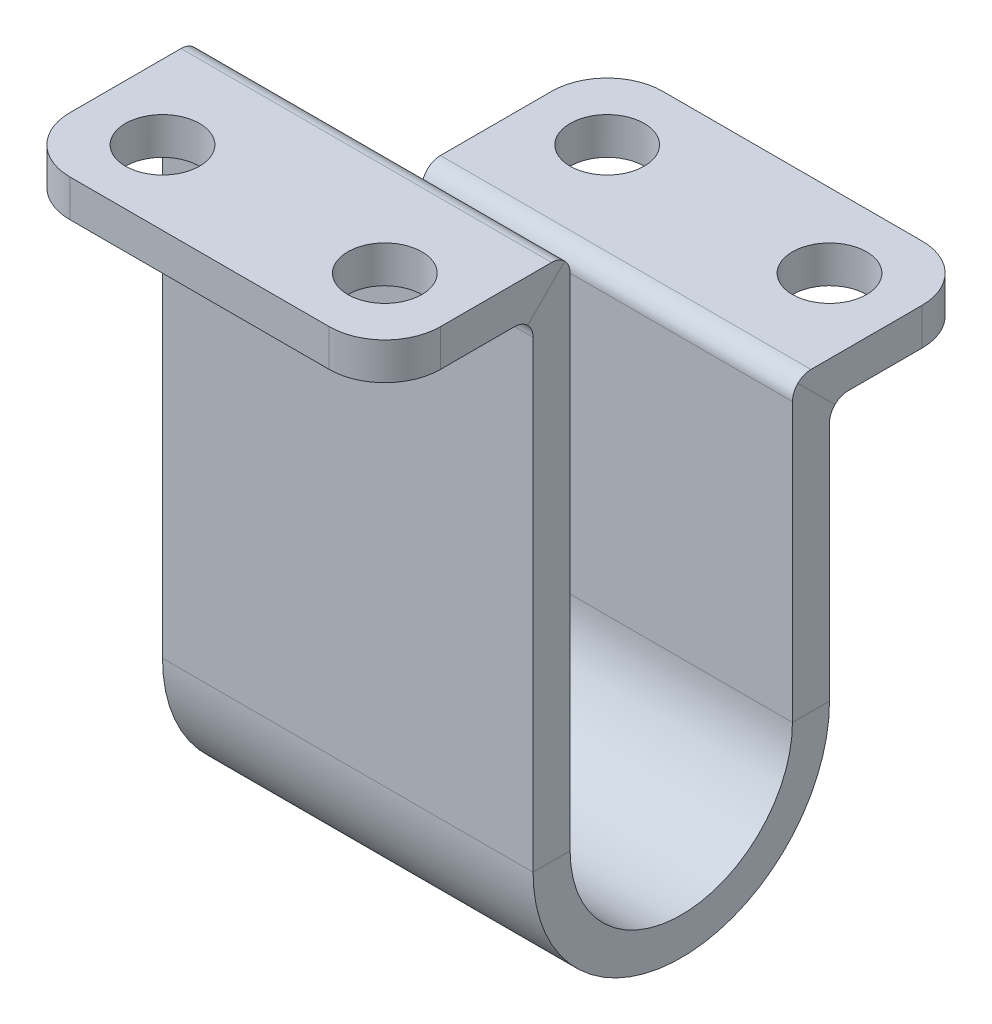
ISO-10303-21;
HEADER;
FILE_DESCRIPTION(('STEP AP214'),'2;1');
FILE_NAME('part.step','',(''),(''),'','','');
FILE_SCHEMA(('AUTOMOTIVE_DESIGN { 1 0 10303 214 1 1 1 1 }'));
ENDSEC;
DATA;
#1=APPLICATION_CONTEXT('core data for automotive mechanical design processes');
#2=APPLICATION_PROTOCOL_DEFINITION('international standard','automotive_design',2000,#1);
#3=PRODUCT_CONTEXT('',#1,'mechanical');
#4=PRODUCT('Part','Part','',(#3));
#5=PRODUCT_RELATED_PRODUCT_CATEGORY('part','',(#4));
#6=PRODUCT_DEFINITION_FORMATION('','',#4);
#7=PRODUCT_DEFINITION_CONTEXT('part definition',#1,'design');
#8=PRODUCT_DEFINITION('design','',#6,#7);
#9=PRODUCT_DEFINITION_SHAPE('','',#8);
#10=(LENGTH_UNIT() NAMED_UNIT(*) SI_UNIT(.MILLI.,.METRE.));
#11=(NAMED_UNIT(*) PLANE_ANGLE_UNIT() SI_UNIT($,.RADIAN.));
#12=(NAMED_UNIT(*) SI_UNIT($,.STERADIAN.) SOLID_ANGLE_UNIT());
#13=UNCERTAINTY_MEASURE_WITH_UNIT(LENGTH_MEASURE(1.E-05),#10,'distance_accuracy_value','');
#14=(GEOMETRIC_REPRESENTATION_CONTEXT(3) GLOBAL_UNCERTAINTY_ASSIGNED_CONTEXT((#13)) GLOBAL_UNIT_ASSIGNED_CONTEXT((#10,
#11,#12)) REPRESENTATION_CONTEXT('',''));
#15=CARTESIAN_POINT('',(0.,0.,0.));
#16=DIRECTION('',(0.,0.,1.));
#17=DIRECTION('',(1.,0.,0.));
#18=AXIS2_PLACEMENT_3D('',#15,#16,#17);
#19=CARTESIAN_POINT('',(0.,-30.,-80.));
#20=DIRECTION('',(0.,0.,1.));
#21=DIRECTION('',(1.,0.,0.));
#22=AXIS2_PLACEMENT_3D('',#19,#20,#21);
#23=PLANE('',#22);
#24=DIRECTION('',(-1.,0.,0.));
#25=VECTOR('',#24,1.);
#26=CARTESIAN_POINT('',(-25.,-27.5,-80.));
#27=LINE('',#26,#25);
#28=CARTESIAN_POINT('',(17.5,-27.5,-80.));
#29=VERTEX_POINT('',#28);
#30=CARTESIAN_POINT('',(-17.5,-27.5,-80.));
#31=VERTEX_POINT('',#30);
#32=EDGE_CURVE('E281',#29,#31,#27,.T.);
#33=ORIENTED_EDGE('',*,*,#32,.F.);
#34=DIRECTION('',(0.,1.,0.));
#35=VECTOR('',#34,1.);
#36=CARTESIAN_POINT('',(17.5,-30.,-80.));
#37=LINE('',#36,#35);
#38=CARTESIAN_POINT('',(17.5,-32.5,-80.));
#39=VERTEX_POINT('',#38);
#40=EDGE_CURVE('E56',#29,#39,#37,.F.);
#41=ORIENTED_EDGE('',*,*,#40,.T.);
#42=DIRECTION('',(1.,0.,0.));
#43=VECTOR('',#42,1.);
#44=CARTESIAN_POINT('',(-25.,-32.5,-80.));
#45=LINE('',#44,#43);
#46=CARTESIAN_POINT('',(-17.5,-32.5,-80.));
#47=VERTEX_POINT('',#46);
#48=EDGE_CURVE('E284',#47,#39,#45,.T.);
#49=ORIENTED_EDGE('',*,*,#48,.F.);
#50=DIRECTION('',(0.,-1.,0.));
#51=VECTOR('',#50,1.);
#52=CARTESIAN_POINT('',(-17.5,-30.,-80.));
#53=LINE('',#52,#51);
#54=EDGE_CURVE('E396',#47,#31,#53,.F.);
#55=ORIENTED_EDGE('',*,*,#54,.T.);
#56=EDGE_LOOP('',(#33,#41,#49,#55));
#57=FACE_BOUND('',#56,.T.);
#58=ADVANCED_FACE('F34',(#57),#23,.F.);
#59=CARTESIAN_POINT('',(0.,0.,0.));
#60=DIRECTION('',(0.,0.,1.));
#61=DIRECTION('',(1.,0.,0.));
#62=AXIS2_PLACEMENT_3D('',#59,#60,#61);
#63=PLANE('',#62);
#64=DIRECTION('',(1.,0.,0.));
#65=VECTOR('',#64,1.);
#66=CARTESIAN_POINT('',(-25.,-2.5,0.));
#67=LINE('',#66,#65);
#68=CARTESIAN_POINT('',(-17.5,-2.5,0.));
#69=VERTEX_POINT('',#68);
#70=CARTESIAN_POINT('',(17.5,-2.5,0.));
#71=VERTEX_POINT('',#70);
#72=EDGE_CURVE('E280',#69,#71,#67,.T.);
#73=ORIENTED_EDGE('',*,*,#72,.T.);
#74=DIRECTION('',(0.,1.,0.));
#75=VECTOR('',#74,1.);
#76=CARTESIAN_POINT('',(17.5,2.5,0.));
#77=LINE('',#76,#75);
#78=CARTESIAN_POINT('',(17.5,2.5,0.));
#79=VERTEX_POINT('',#78);
#80=EDGE_CURVE('E374',#71,#79,#77,.T.);
#81=ORIENTED_EDGE('',*,*,#80,.T.);
#82=DIRECTION('',(-1.,0.,0.));
#83=VECTOR('',#82,1.);
#84=CARTESIAN_POINT('',(-25.,2.5,0.));
#85=LINE('',#84,#83);
#86=CARTESIAN_POINT('',(-17.5,2.5,0.));
#87=VERTEX_POINT('',#86);
#88=EDGE_CURVE('E452',#79,#87,#85,.T.);
#89=ORIENTED_EDGE('',*,*,#88,.T.);
#90=DIRECTION('',(0.,-1.,0.));
#91=VECTOR('',#90,1.);
#92=CARTESIAN_POINT('',(-17.5,-2.5,0.));
#93=LINE('',#92,#91);
#94=EDGE_CURVE('E357',#87,#69,#93,.T.);
#95=ORIENTED_EDGE('',*,*,#94,.T.);
#96=EDGE_LOOP('',(#73,#81,#89,#95));
#97=FACE_BOUND('',#96,.T.);
#98=ADVANCED_FACE('F490',(#97),#63,.T.);
#99=CARTESIAN_POINT('',(-25.,-27.5,-54.65));
#100=DIRECTION('',(1.,0.,0.));
#101=DIRECTION('',(0.,0.,-1.));
#102=AXIS2_PLACEMENT_3D('',#99,#100,#101);
#103=PLANE('',#102);
#104=DIRECTION('',(0.,0.,-1.));
#105=VECTOR('',#104,1.);
#106=CARTESIAN_POINT('',(-25.,-27.5,-54.65));
#107=LINE('',#106,#105);
#108=CARTESIAN_POINT('',(-25.,-27.5,-57.5));
#109=VERTEX_POINT('',#108);
#110=CARTESIAN_POINT('',(-25.,-27.5,-72.5));
#111=VERTEX_POINT('',#110);
#112=EDGE_CURVE('E268',#109,#111,#107,.T.);
#113=ORIENTED_EDGE('',*,*,#112,.T.);
#114=DIRECTION('',(0.,-1.,0.));
#115=VECTOR('',#114,1.);
#116=CARTESIAN_POINT('',(-25.,-27.5,-72.5));
#117=LINE('',#116,#115);
#118=CARTESIAN_POINT('',(-25.,-32.5,-72.5));
#119=VERTEX_POINT('',#118);
#120=EDGE_CURVE('E11',#111,#119,#117,.T.);
#121=ORIENTED_EDGE('',*,*,#120,.T.);
#122=DIRECTION('',(0.,0.,-1.));
#123=VECTOR('',#122,1.);
#124=CARTESIAN_POINT('',(-25.,-32.5,-54.65));
#125=LINE('',#124,#123);
#126=CARTESIAN_POINT('',(-25.,-32.5,-62.5));
#127=VERTEX_POINT('',#126);
#128=EDGE_CURVE('E293',#127,#119,#125,.T.);
#129=ORIENTED_EDGE('',*,*,#128,.F.);
#130=CARTESIAN_POINT('',(-25.,-35.,-62.5));
#131=DIRECTION('',(1.,0.,0.));
#132=DIRECTION('',(0.,0.,-1.));
#133=AXIS2_PLACEMENT_3D('',#130,#131,#132);
#134=CIRCLE('',#133,2.5);
#135=CARTESIAN_POINT('',(-25.,-33.2322330470336,-60.7322330470336));
#136=VERTEX_POINT('',#135);
#137=EDGE_CURVE('E336',#127,#136,#134,.T.);
#138=ORIENTED_EDGE('',*,*,#137,.T.);
#139=DIRECTION('',(0.,0.707106781186548,0.707106781186548));
#140=VECTOR('',#139,1.);
#141=CARTESIAN_POINT('',(-25.,-47.5,-75.));
#142=LINE('',#141,#140);
#143=CARTESIAN_POINT('',(-25.,-28.2322330470336,-55.7322330470336));
#144=VERTEX_POINT('',#143);
#145=EDGE_CURVE('E211',#136,#144,#142,.T.);
#146=ORIENTED_EDGE('',*,*,#145,.T.);
#147=CARTESIAN_POINT('',(-25.,-30.,-57.5));
#148=DIRECTION('',(1.,0.,0.));
#149=DIRECTION('',(0.,0.,-1.));
#150=AXIS2_PLACEMENT_3D('',#147,#148,#149);
#151=CIRCLE('',#150,2.5);
#152=EDGE_CURVE('E315',#144,#109,#151,.F.);
#153=ORIENTED_EDGE('',*,*,#152,.T.);
#154=EDGE_LOOP('',(#113,#121,#129,#138,#146,#153));
#155=FACE_BOUND('',#154,.T.);
#156=ADVANCED_FACE('F417',(#155),#103,.F.);
#157=CARTESIAN_POINT('',(-25.,-32.5,-54.65));
#158=DIRECTION('',(0.,1.,0.));
#159=DIRECTION('',(0.,0.,1.));
#160=AXIS2_PLACEMENT_3D('',#157,#158,#159);
#161=PLANE('',#160);
#162=CARTESIAN_POINT('',(15.,-32.5,-70.));
#163=DIRECTION('',(0.,1.,0.));
#164=DIRECTION('',(0.,0.,1.));
#165=AXIS2_PLACEMENT_3D('',#162,#163,#164);
#166=CIRCLE('',#165,5.00000000000001);
#167=CARTESIAN_POINT('',(15.,-32.5,-65.));
#168=VERTEX_POINT('',#167);
#169=EDGE_CURVE('E285',#168,#168,#166,.T.);
#170=ORIENTED_EDGE('',*,*,#169,.T.);
#171=EDGE_LOOP('',(#170));
#172=FACE_BOUND('',#171,.T.);
#173=CARTESIAN_POINT('',(-15.,-32.5,-70.));
#174=DIRECTION('',(0.,1.,0.));
#175=DIRECTION('',(0.,0.,1.));
#176=AXIS2_PLACEMENT_3D('',#173,#174,#175);
#177=CIRCLE('',#176,5.00000000000001);
#178=CARTESIAN_POINT('',(-15.,-32.5,-65.));
#179=VERTEX_POINT('',#178);
#180=EDGE_CURVE('E368',#179,#179,#177,.T.);
#181=ORIENTED_EDGE('',*,*,#180,.T.);
#182=EDGE_LOOP('',(#181));
#183=FACE_BOUND('',#182,.T.);
#184=ORIENTED_EDGE('',*,*,#48,.T.);
#185=CARTESIAN_POINT('',(17.5,-32.5,-72.5));
#186=DIRECTION('',(0.,1.,0.));
#187=DIRECTION('',(0.,0.,1.));
#188=AXIS2_PLACEMENT_3D('',#185,#186,#187);
#189=CIRCLE('',#188,7.5);
#190=CARTESIAN_POINT('',(25.,-32.5,-72.5));
#191=VERTEX_POINT('',#190);
#192=EDGE_CURVE('E42',#39,#191,#189,.F.);
#193=ORIENTED_EDGE('',*,*,#192,.T.);
#194=DIRECTION('',(0.,0.,-1.));
#195=VECTOR('',#194,1.);
#196=CARTESIAN_POINT('',(25.,-32.5,-54.65));
#197=LINE('',#196,#195);
#198=CARTESIAN_POINT('',(25.,-32.5,-62.5));
#199=VERTEX_POINT('',#198);
#200=EDGE_CURVE('E290',#199,#191,#197,.T.);
#201=ORIENTED_EDGE('',*,*,#200,.F.);
#202=DIRECTION('',(-1.,0.,0.));
#203=VECTOR('',#202,1.);
#204=CARTESIAN_POINT('',(-25.,-32.5,-62.5));
#205=LINE('',#204,#203);
#206=EDGE_CURVE('E298',#199,#127,#205,.T.);
#207=ORIENTED_EDGE('',*,*,#206,.T.);
#208=ORIENTED_EDGE('',*,*,#128,.T.);
#209=CARTESIAN_POINT('',(-17.5,-32.5,-72.5));
#210=DIRECTION('',(0.,1.,0.));
#211=DIRECTION('',(0.,0.,1.));
#212=AXIS2_PLACEMENT_3D('',#209,#210,#211);
#213=CIRCLE('',#212,7.5);
#214=EDGE_CURVE('E49',#119,#47,#213,.F.);
#215=ORIENTED_EDGE('',*,*,#214,.T.);
#216=EDGE_LOOP('',(#184,#193,#201,#207,#208,#215));
#217=FACE_BOUND('',#216,.T.);
#218=ADVANCED_FACE('F402',(#172,#183,#217),#161,.F.);
#219=CARTESIAN_POINT('',(25.,-27.5,-54.65));
#220=DIRECTION('',(-1.,0.,0.));
#221=DIRECTION('',(0.,0.,1.));
#222=AXIS2_PLACEMENT_3D('',#219,#220,#221);
#223=PLANE('',#222);
#224=ORIENTED_EDGE('',*,*,#200,.T.);
#225=DIRECTION('',(0.,1.,0.));
#226=VECTOR('',#225,1.);
#227=CARTESIAN_POINT('',(25.,-27.5,-72.5));
#228=LINE('',#227,#226);
#229=CARTESIAN_POINT('',(25.,-27.5,-72.5));
#230=VERTEX_POINT('',#229);
#231=EDGE_CURVE('E389',#191,#230,#228,.T.);
#232=ORIENTED_EDGE('',*,*,#231,.T.);
#233=DIRECTION('',(0.,0.,-1.));
#234=VECTOR('',#233,1.);
#235=CARTESIAN_POINT('',(25.,-27.5,-54.65));
#236=LINE('',#235,#234);
#237=CARTESIAN_POINT('',(25.,-27.5,-57.5));
#238=VERTEX_POINT('',#237);
#239=EDGE_CURVE('E287',#238,#230,#236,.T.);
#240=ORIENTED_EDGE('',*,*,#239,.F.);
#241=CARTESIAN_POINT('',(25.,-30.,-57.5));
#242=DIRECTION('',(-1.,0.,0.));
#243=DIRECTION('',(0.,0.,1.));
#244=AXIS2_PLACEMENT_3D('',#241,#242,#243);
#245=CIRCLE('',#244,2.5);
#246=CARTESIAN_POINT('',(25.,-28.2322330470336,-55.7322330470336));
#247=VERTEX_POINT('',#246);
#248=EDGE_CURVE('E307',#238,#247,#245,.F.);
#249=ORIENTED_EDGE('',*,*,#248,.T.);
#250=DIRECTION('',(0.,-0.707106781186548,-0.707106781186548));
#251=VECTOR('',#250,1.);
#252=CARTESIAN_POINT('',(25.,-47.5,-75.));
#253=LINE('',#252,#251);
#254=CARTESIAN_POINT('',(25.,-33.2322330470336,-60.7322330470336));
#255=VERTEX_POINT('',#254);
#256=EDGE_CURVE('E266',#247,#255,#253,.T.);
#257=ORIENTED_EDGE('',*,*,#256,.T.);
#258=CARTESIAN_POINT('',(25.,-35.,-62.5));
#259=DIRECTION('',(-1.,0.,0.));
#260=DIRECTION('',(0.,0.,1.));
#261=AXIS2_PLACEMENT_3D('',#258,#259,#260);
#262=CIRCLE('',#261,2.5);
#263=EDGE_CURVE('E344',#255,#199,#262,.T.);
#264=ORIENTED_EDGE('',*,*,#263,.T.);
#265=EDGE_LOOP('',(#224,#232,#240,#249,#257,#264));
#266=FACE_BOUND('',#265,.T.);
#267=ADVANCED_FACE('F407',(#266),#223,.F.);
#268=CARTESIAN_POINT('',(-25.,-27.5,-54.65));
#269=DIRECTION('',(0.,-1.,0.));
#270=DIRECTION('',(0.,0.,-1.));
#271=AXIS2_PLACEMENT_3D('',#268,#269,#270);
#272=PLANE('',#271);
#273=CARTESIAN_POINT('',(15.,-27.5,-70.));
#274=DIRECTION('',(0.,-1.,0.));
#275=DIRECTION('',(0.,0.,-1.));
#276=AXIS2_PLACEMENT_3D('',#273,#274,#275);
#277=CIRCLE('',#276,5.00000000000001);
#278=CARTESIAN_POINT('',(15.,-27.5,-75.));
#279=VERTEX_POINT('',#278);
#280=EDGE_CURVE('E369',#279,#279,#277,.T.);
#281=ORIENTED_EDGE('',*,*,#280,.T.);
#282=EDGE_LOOP('',(#281));
#283=FACE_BOUND('',#282,.T.);
#284=CARTESIAN_POINT('',(-15.,-27.5,-70.));
#285=DIRECTION('',(0.,-1.,0.));
#286=DIRECTION('',(0.,0.,-1.));
#287=AXIS2_PLACEMENT_3D('',#284,#285,#286);
#288=CIRCLE('',#287,5.00000000000001);
#289=CARTESIAN_POINT('',(-15.,-27.5,-75.));
#290=VERTEX_POINT('',#289);
#291=EDGE_CURVE('E365',#290,#290,#288,.T.);
#292=ORIENTED_EDGE('',*,*,#291,.T.);
#293=EDGE_LOOP('',(#292));
#294=FACE_BOUND('',#293,.T.);
#295=ORIENTED_EDGE('',*,*,#239,.T.);
#296=CARTESIAN_POINT('',(17.5,-27.5,-72.5));
#297=DIRECTION('',(0.,-1.,0.));
#298=DIRECTION('',(0.,0.,-1.));
#299=AXIS2_PLACEMENT_3D('',#296,#297,#298);
#300=CIRCLE('',#299,7.5);
#301=EDGE_CURVE('E394',#230,#29,#300,.F.);
#302=ORIENTED_EDGE('',*,*,#301,.T.);
#303=ORIENTED_EDGE('',*,*,#32,.T.);
#304=CARTESIAN_POINT('',(-17.5,-27.5,-72.5));
#305=DIRECTION('',(0.,-1.,0.));
#306=DIRECTION('',(0.,0.,-1.));
#307=AXIS2_PLACEMENT_3D('',#304,#305,#306);
#308=CIRCLE('',#307,7.5);
#309=EDGE_CURVE('E392',#31,#111,#308,.F.);
#310=ORIENTED_EDGE('',*,*,#309,.T.);
#311=ORIENTED_EDGE('',*,*,#112,.F.);
#312=DIRECTION('',(1.,0.,0.));
#313=VECTOR('',#312,1.);
#314=CARTESIAN_POINT('',(-25.,-27.5,-57.5));
#315=LINE('',#314,#313);
#316=EDGE_CURVE('E304',#109,#238,#315,.T.);
#317=ORIENTED_EDGE('',*,*,#316,.T.);
#318=EDGE_LOOP('',(#295,#302,#303,#310,#311,#317));
#319=FACE_BOUND('',#318,.T.);
#320=ADVANCED_FACE('F412',(#283,#294,#319),#272,.F.);
#321=CARTESIAN_POINT('',(-25.,2.85,-25.));
#322=DIRECTION('',(1.,0.,0.));
#323=DIRECTION('',(0.,0.,-1.));
#324=AXIS2_PLACEMENT_3D('',#321,#322,#323);
#325=PLANE('',#324);
#326=DIRECTION('',(0.,0.707106781186548,-0.707106781186548));
#327=VECTOR('',#326,1.);
#328=CARTESIAN_POINT('',(-25.,-10.,-12.5));
#329=LINE('',#328,#327);
#330=CARTESIAN_POINT('',(-25.,-3.23223304703363,-19.2677669529664));
#331=VERTEX_POINT('',#330);
#332=CARTESIAN_POINT('',(-25.,1.76776695296637,-24.2677669529664));
#333=VERTEX_POINT('',#332);
#334=EDGE_CURVE('E449',#331,#333,#329,.T.);
#335=ORIENTED_EDGE('',*,*,#334,.T.);
#336=CARTESIAN_POINT('',(-25.,0.,-22.5));
#337=DIRECTION('',(1.,0.,0.));
#338=DIRECTION('',(0.,0.,-1.));
#339=AXIS2_PLACEMENT_3D('',#336,#337,#338);
#340=CIRCLE('',#339,2.5);
#341=CARTESIAN_POINT('',(-25.,0.,-25.));
#342=VERTEX_POINT('',#341);
#343=EDGE_CURVE('E205',#333,#342,#340,.F.);
#344=ORIENTED_EDGE('',*,*,#343,.T.);
#345=DIRECTION('',(0.,-1.,0.));
#346=VECTOR('',#345,1.);
#347=CARTESIAN_POINT('',(-25.,2.85,-25.));
#348=LINE('',#347,#346);
#349=CARTESIAN_POINT('',(-25.,-67.5,-25.));
#350=VERTEX_POINT('',#349);
#351=EDGE_CURVE('E197',#342,#350,#348,.T.);
#352=ORIENTED_EDGE('',*,*,#351,.T.);
#353=DIRECTION('',(0.,0.,1.));
#354=VECTOR('',#353,1.);
#355=CARTESIAN_POINT('',(-25.,-67.5,-25.));
#356=LINE('',#355,#354);
#357=CARTESIAN_POINT('',(-25.,-67.5,-20.));
#358=VERTEX_POINT('',#357);
#359=EDGE_CURVE('E203',#350,#358,#356,.T.);
#360=ORIENTED_EDGE('',*,*,#359,.T.);
#361=DIRECTION('',(0.,-1.,0.));
#362=VECTOR('',#361,1.);
#363=CARTESIAN_POINT('',(-25.,2.85,-20.));
#364=LINE('',#363,#362);
#365=CARTESIAN_POINT('',(-25.,-5.,-20.));
#366=VERTEX_POINT('',#365);
#367=EDGE_CURVE('E210',#366,#358,#364,.T.);
#368=ORIENTED_EDGE('',*,*,#367,.F.);
#369=CARTESIAN_POINT('',(-25.,-5.,-17.5));
#370=DIRECTION('',(1.,0.,0.));
#371=DIRECTION('',(0.,0.,-1.));
#372=AXIS2_PLACEMENT_3D('',#369,#370,#371);
#373=CIRCLE('',#372,2.5);
#374=EDGE_CURVE('E346',#366,#331,#373,.T.);
#375=ORIENTED_EDGE('',*,*,#374,.T.);
#376=EDGE_LOOP('',(#335,#344,#352,#360,#368,#375));
#377=FACE_BOUND('',#376,.T.);
#378=ADVANCED_FACE('F200',(#377),#325,.F.);
#379=CARTESIAN_POINT('',(-25.,2.85,-20.));
#380=DIRECTION('',(0.,0.,-1.));
#381=DIRECTION('',(0.,1.,0.));
#382=AXIS2_PLACEMENT_3D('',#379,#380,#381);
#383=PLANE('',#382);
#384=DIRECTION('',(0.,-1.,0.));
#385=VECTOR('',#384,1.);
#386=CARTESIAN_POINT('',(25.,2.85,-20.));
#387=LINE('',#386,#385);
#388=CARTESIAN_POINT('',(25.,-5.,-20.));
#389=VERTEX_POINT('',#388);
#390=CARTESIAN_POINT('',(25.,-67.5,-20.));
#391=VERTEX_POINT('',#390);
#392=EDGE_CURVE('E244',#389,#391,#387,.T.);
#393=ORIENTED_EDGE('',*,*,#392,.F.);
#394=DIRECTION('',(-1.,0.,0.));
#395=VECTOR('',#394,1.);
#396=CARTESIAN_POINT('',(-25.,-5.,-20.));
#397=LINE('',#396,#395);
#398=EDGE_CURVE('E330',#389,#366,#397,.T.);
#399=ORIENTED_EDGE('',*,*,#398,.T.);
#400=ORIENTED_EDGE('',*,*,#367,.T.);
#401=DIRECTION('',(1.,0.,0.));
#402=VECTOR('',#401,1.);
#403=CARTESIAN_POINT('',(-25.,-67.5,-20.));
#404=LINE('',#403,#402);
#405=EDGE_CURVE('E240',#358,#391,#404,.T.);
#406=ORIENTED_EDGE('',*,*,#405,.T.);
#407=EDGE_LOOP('',(#393,#399,#400,#406));
#408=FACE_BOUND('',#407,.T.);
#409=ADVANCED_FACE('F445',(#408),#383,.F.);
#410=CARTESIAN_POINT('',(25.,2.85,-25.));
#411=DIRECTION('',(-1.,0.,0.));
#412=DIRECTION('',(0.,0.,1.));
#413=AXIS2_PLACEMENT_3D('',#410,#411,#412);
#414=PLANE('',#413);
#415=DIRECTION('',(0.,-1.,0.));
#416=VECTOR('',#415,1.);
#417=CARTESIAN_POINT('',(25.,2.85,-25.));
#418=LINE('',#417,#416);
#419=CARTESIAN_POINT('',(25.,0.,-25.));
#420=VERTEX_POINT('',#419);
#421=CARTESIAN_POINT('',(25.,-67.5,-25.));
#422=VERTEX_POINT('',#421);
#423=EDGE_CURVE('E231',#420,#422,#418,.T.);
#424=ORIENTED_EDGE('',*,*,#423,.F.);
#425=CARTESIAN_POINT('',(25.,0.,-22.5));
#426=DIRECTION('',(-1.,0.,0.));
#427=DIRECTION('',(0.,0.,1.));
#428=AXIS2_PLACEMENT_3D('',#425,#426,#427);
#429=CIRCLE('',#428,2.5);
#430=CARTESIAN_POINT('',(25.,1.76776695296637,-24.2677669529664));
#431=VERTEX_POINT('',#430);
#432=EDGE_CURVE('E319',#420,#431,#429,.F.);
#433=ORIENTED_EDGE('',*,*,#432,.T.);
#434=DIRECTION('',(0.,-0.707106781186548,0.707106781186548));
#435=VECTOR('',#434,1.);
#436=CARTESIAN_POINT('',(25.,-10.,-12.5));
#437=LINE('',#436,#435);
#438=CARTESIAN_POINT('',(25.,-3.23223304703363,-19.2677669529664));
#439=VERTEX_POINT('',#438);
#440=EDGE_CURVE('E302',#431,#439,#437,.T.);
#441=ORIENTED_EDGE('',*,*,#440,.T.);
#442=CARTESIAN_POINT('',(25.,-5.,-17.5));
#443=DIRECTION('',(-1.,0.,0.));
#444=DIRECTION('',(0.,0.,1.));
#445=AXIS2_PLACEMENT_3D('',#442,#443,#444);
#446=CIRCLE('',#445,2.5);
#447=EDGE_CURVE('E355',#439,#389,#446,.T.);
#448=ORIENTED_EDGE('',*,*,#447,.T.);
#449=ORIENTED_EDGE('',*,*,#392,.T.);
#450=DIRECTION('',(0.,0.,-1.));
#451=VECTOR('',#450,1.);
#452=CARTESIAN_POINT('',(25.,-67.5,-25.));
#453=LINE('',#452,#451);
#454=EDGE_CURVE('E233',#391,#422,#453,.T.);
#455=ORIENTED_EDGE('',*,*,#454,.T.);
#456=EDGE_LOOP('',(#424,#433,#441,#448,#449,#455));
#457=FACE_BOUND('',#456,.T.);
#458=ADVANCED_FACE('F520',(#457),#414,.F.);
#459=CARTESIAN_POINT('',(-25.,2.85,-25.));
#460=DIRECTION('',(0.,0.,1.));
#461=DIRECTION('',(0.,-1.,0.));
#462=AXIS2_PLACEMENT_3D('',#459,#460,#461);
#463=PLANE('',#462);
#464=ORIENTED_EDGE('',*,*,#351,.F.);
#465=DIRECTION('',(1.,0.,0.));
#466=VECTOR('',#465,1.);
#467=CARTESIAN_POINT('',(-25.,0.,-25.));
#468=LINE('',#467,#466);
#469=EDGE_CURVE('E317',#342,#420,#468,.T.);
#470=ORIENTED_EDGE('',*,*,#469,.T.);
#471=ORIENTED_EDGE('',*,*,#423,.T.);
#472=DIRECTION('',(-1.,0.,0.));
#473=VECTOR('',#472,1.);
#474=CARTESIAN_POINT('',(-25.,-67.5,-25.));
#475=LINE('',#474,#473);
#476=EDGE_CURVE('E220',#422,#350,#475,.T.);
#477=ORIENTED_EDGE('',*,*,#476,.T.);
#478=EDGE_LOOP('',(#464,#470,#471,#477));
#479=FACE_BOUND('',#478,.T.);
#480=ADVANCED_FACE('F229',(#479),#463,.F.);
#481=CARTESIAN_POINT('',(-25.,-67.5,-25.));
#482=DIRECTION('',(1.,0.,0.));
#483=DIRECTION('',(0.,0.,-1.));
#484=AXIS2_PLACEMENT_3D('',#481,#482,#483);
#485=PLANE('',#484);
#486=CARTESIAN_POINT('',(-25.,-67.5,-40.));
#487=DIRECTION('',(1.,0.,0.));
#488=DIRECTION('',(0.,0.,1.));
#489=AXIS2_PLACEMENT_3D('',#486,#487,#488);
#490=CIRCLE('',#489,20.);
#491=CARTESIAN_POINT('',(-25.,-67.5,-60.));
#492=VERTEX_POINT('',#491);
#493=EDGE_CURVE('E238',#358,#492,#490,.T.);
#494=ORIENTED_EDGE('',*,*,#493,.F.);
#495=ORIENTED_EDGE('',*,*,#359,.F.);
#496=CARTESIAN_POINT('',(-25.,-67.5,-40.));
#497=DIRECTION('',(1.,0.,0.));
#498=DIRECTION('',(0.,0.,1.));
#499=AXIS2_PLACEMENT_3D('',#496,#497,#498);
#500=CIRCLE('',#499,15.);
#501=CARTESIAN_POINT('',(-25.,-67.5,-55.));
#502=VERTEX_POINT('',#501);
#503=EDGE_CURVE('E217',#350,#502,#500,.T.);
#504=ORIENTED_EDGE('',*,*,#503,.T.);
#505=DIRECTION('',(0.,0.,-1.));
#506=VECTOR('',#505,1.);
#507=CARTESIAN_POINT('',(-25.,-67.5,-55.));
#508=LINE('',#507,#506);
#509=EDGE_CURVE('E227',#502,#492,#508,.T.);
#510=ORIENTED_EDGE('',*,*,#509,.T.);
#511=EDGE_LOOP('',(#494,#495,#504,#510));
#512=FACE_BOUND('',#511,.T.);
#513=ADVANCED_FACE('F236',(#512),#485,.F.);
#514=CARTESIAN_POINT('',(0.,-67.5,-40.));
#515=DIRECTION('',(1.,0.,0.));
#516=DIRECTION('',(0.,0.,-1.));
#517=AXIS2_PLACEMENT_3D('',#514,#515,#516);
#518=CYLINDRICAL_SURFACE('',#517,20.);
#519=CARTESIAN_POINT('',(25.,-67.5,-40.));
#520=DIRECTION('',(1.,0.,0.));
#521=DIRECTION('',(0.,0.,1.));
#522=AXIS2_PLACEMENT_3D('',#519,#520,#521);
#523=CIRCLE('',#522,20.);
#524=CARTESIAN_POINT('',(25.,-67.5,-60.));
#525=VERTEX_POINT('',#524);
#526=EDGE_CURVE('E253',#391,#525,#523,.T.);
#527=ORIENTED_EDGE('',*,*,#526,.F.);
#528=ORIENTED_EDGE('',*,*,#405,.F.);
#529=ORIENTED_EDGE('',*,*,#493,.T.);
#530=DIRECTION('',(1.,0.,0.));
#531=VECTOR('',#530,1.);
#532=CARTESIAN_POINT('',(-25.,-67.5,-60.));
#533=LINE('',#532,#531);
#534=EDGE_CURVE('E249',#492,#525,#533,.T.);
#535=ORIENTED_EDGE('',*,*,#534,.T.);
#536=EDGE_LOOP('',(#527,#528,#529,#535));
#537=FACE_BOUND('',#536,.T.);
#538=ADVANCED_FACE('F441',(#537),#518,.T.);
#539=CARTESIAN_POINT('',(25.,-67.5,-25.));
#540=DIRECTION('',(-1.,0.,0.));
#541=DIRECTION('',(0.,0.,1.));
#542=AXIS2_PLACEMENT_3D('',#539,#540,#541);
#543=PLANE('',#542);
#544=CARTESIAN_POINT('',(25.,-67.5,-40.));
#545=DIRECTION('',(1.,0.,0.));
#546=DIRECTION('',(0.,0.,1.));
#547=AXIS2_PLACEMENT_3D('',#544,#545,#546);
#548=CIRCLE('',#547,15.);
#549=CARTESIAN_POINT('',(25.,-67.5,-55.));
#550=VERTEX_POINT('',#549);
#551=EDGE_CURVE('E260',#422,#550,#548,.T.);
#552=ORIENTED_EDGE('',*,*,#551,.F.);
#553=ORIENTED_EDGE('',*,*,#454,.F.);
#554=ORIENTED_EDGE('',*,*,#526,.T.);
#555=DIRECTION('',(0.,0.,1.));
#556=VECTOR('',#555,1.);
#557=CARTESIAN_POINT('',(25.,-67.5,-55.));
#558=LINE('',#557,#556);
#559=EDGE_CURVE('E256',#525,#550,#558,.T.);
#560=ORIENTED_EDGE('',*,*,#559,.T.);
#561=EDGE_LOOP('',(#552,#553,#554,#560));
#562=FACE_BOUND('',#561,.T.);
#563=ADVANCED_FACE('F522',(#562),#543,.F.);
#564=CARTESIAN_POINT('',(0.,-67.5,-40.));
#565=DIRECTION('',(1.,0.,0.));
#566=DIRECTION('',(0.,0.,-1.));
#567=AXIS2_PLACEMENT_3D('',#564,#565,#566);
#568=CYLINDRICAL_SURFACE('',#567,15.);
#569=DIRECTION('',(-1.,0.,0.));
#570=VECTOR('',#569,1.);
#571=CARTESIAN_POINT('',(-25.,-67.5,-55.));
#572=LINE('',#571,#570);
#573=EDGE_CURVE('E223',#550,#502,#572,.T.);
#574=ORIENTED_EDGE('',*,*,#573,.T.);
#575=ORIENTED_EDGE('',*,*,#503,.F.);
#576=ORIENTED_EDGE('',*,*,#476,.F.);
#577=ORIENTED_EDGE('',*,*,#551,.T.);
#578=EDGE_LOOP('',(#574,#575,#576,#577));
#579=FACE_BOUND('',#578,.T.);
#580=ADVANCED_FACE('F218',(#579),#568,.F.);
#581=CARTESIAN_POINT('',(-25.,-67.5,-55.));
#582=DIRECTION('',(1.,0.,0.));
#583=DIRECTION('',(0.,0.,-1.));
#584=AXIS2_PLACEMENT_3D('',#581,#582,#583);
#585=PLANE('',#584);
#586=DIRECTION('',(0.,1.,0.));
#587=VECTOR('',#586,1.);
#588=CARTESIAN_POINT('',(-25.,-67.5,-55.));
#589=LINE('',#588,#587);
#590=CARTESIAN_POINT('',(-25.,-30.,-55.));
#591=VERTEX_POINT('',#590);
#592=EDGE_CURVE('E263',#502,#591,#589,.T.);
#593=ORIENTED_EDGE('',*,*,#592,.T.);
#594=CARTESIAN_POINT('',(-25.,-30.,-57.5));
#595=DIRECTION('',(1.,0.,0.));
#596=DIRECTION('',(0.,0.,-1.));
#597=AXIS2_PLACEMENT_3D('',#594,#595,#596);
#598=CIRCLE('',#597,2.5);
#599=EDGE_CURVE('E313',#591,#144,#598,.F.);
#600=ORIENTED_EDGE('',*,*,#599,.T.);
#601=ORIENTED_EDGE('',*,*,#145,.F.);
#602=CARTESIAN_POINT('',(-25.,-35.,-62.5));
#603=DIRECTION('',(1.,0.,0.));
#604=DIRECTION('',(0.,0.,-1.));
#605=AXIS2_PLACEMENT_3D('',#602,#603,#604);
#606=CIRCLE('',#605,2.5);
#607=CARTESIAN_POINT('',(-25.,-35.,-60.));
#608=VERTEX_POINT('',#607);
#609=EDGE_CURVE('E339',#136,#608,#606,.T.);
#610=ORIENTED_EDGE('',*,*,#609,.T.);
#611=DIRECTION('',(0.,1.,0.));
#612=VECTOR('',#611,1.);
#613=CARTESIAN_POINT('',(-25.,-67.5,-60.));
#614=LINE('',#613,#612);
#615=EDGE_CURVE('E271',#492,#608,#614,.T.);
#616=ORIENTED_EDGE('',*,*,#615,.F.);
#617=ORIENTED_EDGE('',*,*,#509,.F.);
#618=EDGE_LOOP('',(#593,#600,#601,#610,#616,#617));
#619=FACE_BOUND('',#618,.T.);
#620=ADVANCED_FACE('F432',(#619),#585,.F.);
#621=CARTESIAN_POINT('',(-25.,-67.5,-60.));
#622=DIRECTION('',(0.,0.,1.));
#623=DIRECTION('',(1.,0.,0.));
#624=AXIS2_PLACEMENT_3D('',#621,#622,#623);
#625=PLANE('',#624);
#626=ORIENTED_EDGE('',*,*,#615,.T.);
#627=DIRECTION('',(-1.,0.,0.));
#628=VECTOR('',#627,1.);
#629=CARTESIAN_POINT('',(25.,-35.,-60.));
#630=LINE('',#629,#628);
#631=CARTESIAN_POINT('',(25.,-35.,-60.));
#632=VERTEX_POINT('',#631);
#633=EDGE_CURVE('E301',#608,#632,#630,.F.);
#634=ORIENTED_EDGE('',*,*,#633,.T.);
#635=DIRECTION('',(0.,1.,0.));
#636=VECTOR('',#635,1.);
#637=CARTESIAN_POINT('',(25.,-67.5,-60.));
#638=LINE('',#637,#636);
#639=EDGE_CURVE('E274',#525,#632,#638,.T.);
#640=ORIENTED_EDGE('',*,*,#639,.F.);
#641=ORIENTED_EDGE('',*,*,#534,.F.);
#642=EDGE_LOOP('',(#626,#634,#640,#641));
#643=FACE_BOUND('',#642,.T.);
#644=ADVANCED_FACE('F437',(#643),#625,.F.);
#645=CARTESIAN_POINT('',(25.,-67.5,-55.));
#646=DIRECTION('',(-1.,0.,0.));
#647=DIRECTION('',(0.,0.,1.));
#648=AXIS2_PLACEMENT_3D('',#645,#646,#647);
#649=PLANE('',#648);
#650=ORIENTED_EDGE('',*,*,#256,.F.);
#651=CARTESIAN_POINT('',(25.,-30.,-57.5));
#652=DIRECTION('',(-1.,0.,0.));
#653=DIRECTION('',(0.,0.,1.));
#654=AXIS2_PLACEMENT_3D('',#651,#652,#653);
#655=CIRCLE('',#654,2.5);
#656=CARTESIAN_POINT('',(25.,-30.,-55.));
#657=VERTEX_POINT('',#656);
#658=EDGE_CURVE('E309',#247,#657,#655,.F.);
#659=ORIENTED_EDGE('',*,*,#658,.T.);
#660=DIRECTION('',(0.,1.,0.));
#661=VECTOR('',#660,1.);
#662=CARTESIAN_POINT('',(25.,-67.5,-55.));
#663=LINE('',#662,#661);
#664=EDGE_CURVE('E277',#550,#657,#663,.T.);
#665=ORIENTED_EDGE('',*,*,#664,.F.);
#666=ORIENTED_EDGE('',*,*,#559,.F.);
#667=ORIENTED_EDGE('',*,*,#639,.T.);
#668=CARTESIAN_POINT('',(25.,-35.,-62.5));
#669=DIRECTION('',(-1.,0.,0.));
#670=DIRECTION('',(0.,0.,1.));
#671=AXIS2_PLACEMENT_3D('',#668,#669,#670);
#672=CIRCLE('',#671,2.5);
#673=EDGE_CURVE('E341',#632,#255,#672,.T.);
#674=ORIENTED_EDGE('',*,*,#673,.T.);
#675=EDGE_LOOP('',(#650,#659,#665,#666,#667,#674));
#676=FACE_BOUND('',#675,.T.);
#677=ADVANCED_FACE('F427',(#676),#649,.F.);
#678=CARTESIAN_POINT('',(-25.,-67.5,-55.));
#679=DIRECTION('',(0.,0.,-1.));
#680=DIRECTION('',(-1.,0.,0.));
#681=AXIS2_PLACEMENT_3D('',#678,#679,#680);
#682=PLANE('',#681);
#683=ORIENTED_EDGE('',*,*,#664,.T.);
#684=DIRECTION('',(1.,0.,0.));
#685=VECTOR('',#684,1.);
#686=CARTESIAN_POINT('',(-25.,-30.,-55.));
#687=LINE('',#686,#685);
#688=EDGE_CURVE('E311',#657,#591,#687,.F.);
#689=ORIENTED_EDGE('',*,*,#688,.T.);
#690=ORIENTED_EDGE('',*,*,#592,.F.);
#691=ORIENTED_EDGE('',*,*,#573,.F.);
#692=EDGE_LOOP('',(#683,#689,#690,#691));
#693=FACE_BOUND('',#692,.T.);
#694=ADVANCED_FACE('F430',(#693),#682,.F.);
#695=CARTESIAN_POINT('',(-25.,2.5,0.));
#696=DIRECTION('',(0.,-1.,0.));
#697=DIRECTION('',(0.,0.,-1.));
#698=AXIS2_PLACEMENT_3D('',#695,#696,#697);
#699=PLANE('',#698);
#700=CARTESIAN_POINT('',(-15.,2.5,-9.99999999999999));
#701=DIRECTION('',(0.,1.,0.));
#702=DIRECTION('',(0.,0.,-1.));
#703=AXIS2_PLACEMENT_3D('',#700,#701,#702);
#704=CIRCLE('',#703,5.00000000000001);
#705=CARTESIAN_POINT('',(-15.,2.5,-15.));
#706=VERTEX_POINT('',#705);
#707=EDGE_CURVE('E469',#706,#706,#704,.T.);
#708=ORIENTED_EDGE('',*,*,#707,.F.);
#709=EDGE_LOOP('',(#708));
#710=FACE_BOUND('',#709,.T.);
#711=CARTESIAN_POINT('',(15.,2.5,-9.99999999999998));
#712=DIRECTION('',(0.,1.,0.));
#713=DIRECTION('',(0.,0.,1.));
#714=AXIS2_PLACEMENT_3D('',#711,#712,#713);
#715=CIRCLE('',#714,5.00000000000001);
#716=CARTESIAN_POINT('',(15.,2.5,-4.99999999999998));
#717=VERTEX_POINT('',#716);
#718=EDGE_CURVE('E362',#717,#717,#715,.T.);
#719=ORIENTED_EDGE('',*,*,#718,.F.);
#720=EDGE_LOOP('',(#719));
#721=FACE_BOUND('',#720,.T.);
#722=ORIENTED_EDGE('',*,*,#88,.F.);
#723=CARTESIAN_POINT('',(17.5,2.5,-7.5));
#724=DIRECTION('',(0.,-1.,0.));
#725=DIRECTION('',(0.,0.,-1.));
#726=AXIS2_PLACEMENT_3D('',#723,#724,#725);
#727=CIRCLE('',#726,7.5);
#728=CARTESIAN_POINT('',(25.,2.5,-7.5));
#729=VERTEX_POINT('',#728);
#730=EDGE_CURVE('E379',#79,#729,#727,.F.);
#731=ORIENTED_EDGE('',*,*,#730,.T.);
#732=DIRECTION('',(0.,0.,-1.));
#733=VECTOR('',#732,1.);
#734=CARTESIAN_POINT('',(25.,2.5,0.));
#735=LINE('',#734,#733);
#736=CARTESIAN_POINT('',(25.,2.5,-22.5));
#737=VERTEX_POINT('',#736);
#738=EDGE_CURVE('E451',#729,#737,#735,.T.);
#739=ORIENTED_EDGE('',*,*,#738,.T.);
#740=DIRECTION('',(1.,0.,0.));
#741=VECTOR('',#740,1.);
#742=CARTESIAN_POINT('',(-25.,2.5,-22.5));
#743=LINE('',#742,#741);
#744=CARTESIAN_POINT('',(-25.,2.5,-22.5));
#745=VERTEX_POINT('',#744);
#746=EDGE_CURVE('E324',#737,#745,#743,.F.);
#747=ORIENTED_EDGE('',*,*,#746,.T.);
#748=DIRECTION('',(0.,0.,-1.));
#749=VECTOR('',#748,1.);
#750=CARTESIAN_POINT('',(-25.,2.5,0.));
#751=LINE('',#750,#749);
#752=CARTESIAN_POINT('',(-25.,2.5,-7.5));
#753=VERTEX_POINT('',#752);
#754=EDGE_CURVE('E455',#753,#745,#751,.T.);
#755=ORIENTED_EDGE('',*,*,#754,.F.);
#756=CARTESIAN_POINT('',(-17.5,2.5,-7.5));
#757=DIRECTION('',(0.,-1.,0.));
#758=DIRECTION('',(0.,0.,-1.));
#759=AXIS2_PLACEMENT_3D('',#756,#757,#758);
#760=CIRCLE('',#759,7.5);
#761=EDGE_CURVE('E377',#753,#87,#760,.F.);
#762=ORIENTED_EDGE('',*,*,#761,.T.);
#763=EDGE_LOOP('',(#722,#731,#739,#747,#755,#762));
#764=FACE_BOUND('',#763,.T.);
#765=ADVANCED_FACE('F478',(#710,#721,#764),#699,.F.);
#766=CARTESIAN_POINT('',(25.,2.5,0.));
#767=DIRECTION('',(-1.,0.,0.));
#768=DIRECTION('',(0.,0.,1.));
#769=AXIS2_PLACEMENT_3D('',#766,#767,#768);
#770=PLANE('',#769);
#771=ORIENTED_EDGE('',*,*,#738,.F.);
#772=DIRECTION('',(0.,1.,0.));
#773=VECTOR('',#772,1.);
#774=CARTESIAN_POINT('',(25.,-2.5,-7.5));
#775=LINE('',#774,#773);
#776=CARTESIAN_POINT('',(25.,-2.5,-7.5));
#777=VERTEX_POINT('',#776);
#778=EDGE_CURVE('E381',#729,#777,#775,.F.);
#779=ORIENTED_EDGE('',*,*,#778,.T.);
#780=DIRECTION('',(0.,0.,-1.));
#781=VECTOR('',#780,1.);
#782=CARTESIAN_POINT('',(25.,-2.5,0.));
#783=LINE('',#782,#781);
#784=CARTESIAN_POINT('',(25.,-2.5,-17.5));
#785=VERTEX_POINT('',#784);
#786=EDGE_CURVE('E457',#777,#785,#783,.T.);
#787=ORIENTED_EDGE('',*,*,#786,.T.);
#788=CARTESIAN_POINT('',(25.,-5.,-17.5));
#789=DIRECTION('',(-1.,0.,0.));
#790=DIRECTION('',(0.,0.,1.));
#791=AXIS2_PLACEMENT_3D('',#788,#789,#790);
#792=CIRCLE('',#791,2.5);
#793=EDGE_CURVE('E352',#785,#439,#792,.T.);
#794=ORIENTED_EDGE('',*,*,#793,.T.);
#795=ORIENTED_EDGE('',*,*,#440,.F.);
#796=CARTESIAN_POINT('',(25.,0.,-22.5));
#797=DIRECTION('',(-1.,0.,0.));
#798=DIRECTION('',(0.,0.,1.));
#799=AXIS2_PLACEMENT_3D('',#796,#797,#798);
#800=CIRCLE('',#799,2.5);
#801=EDGE_CURVE('E321',#431,#737,#800,.F.);
#802=ORIENTED_EDGE('',*,*,#801,.T.);
#803=EDGE_LOOP('',(#771,#779,#787,#794,#795,#802));
#804=FACE_BOUND('',#803,.T.);
#805=ADVANCED_FACE('F481',(#804),#770,.F.);
#806=CARTESIAN_POINT('',(-25.,-2.5,0.));
#807=DIRECTION('',(0.,1.,0.));
#808=DIRECTION('',(0.,0.,1.));
#809=AXIS2_PLACEMENT_3D('',#806,#807,#808);
#810=PLANE('',#809);
#811=CARTESIAN_POINT('',(-15.,-2.5,-9.99999999999999));
#812=DIRECTION('',(0.,1.,0.));
#813=DIRECTION('',(0.,0.,1.));
#814=AXIS2_PLACEMENT_3D('',#811,#812,#813);
#815=CIRCLE('',#814,5.00000000000001);
#816=CARTESIAN_POINT('',(-15.,-2.5,-4.99999999999999));
#817=VERTEX_POINT('',#816);
#818=EDGE_CURVE('E361',#817,#817,#815,.T.);
#819=ORIENTED_EDGE('',*,*,#818,.T.);
#820=EDGE_LOOP('',(#819));
#821=FACE_BOUND('',#820,.T.);
#822=CARTESIAN_POINT('',(15.,-2.5,-9.99999999999998));
#823=DIRECTION('',(0.,1.,0.));
#824=DIRECTION('',(0.,0.,1.));
#825=AXIS2_PLACEMENT_3D('',#822,#823,#824);
#826=CIRCLE('',#825,5.00000000000001);
#827=CARTESIAN_POINT('',(15.,-2.5,-4.99999999999998));
#828=VERTEX_POINT('',#827);
#829=EDGE_CURVE('E358',#828,#828,#826,.T.);
#830=ORIENTED_EDGE('',*,*,#829,.T.);
#831=EDGE_LOOP('',(#830));
#832=FACE_BOUND('',#831,.T.);
#833=ORIENTED_EDGE('',*,*,#786,.F.);
#834=CARTESIAN_POINT('',(17.5,-2.5,-7.5));
#835=DIRECTION('',(0.,1.,0.));
#836=DIRECTION('',(0.,0.,1.));
#837=AXIS2_PLACEMENT_3D('',#834,#835,#836);
#838=CIRCLE('',#837,7.5);
#839=EDGE_CURVE('E385',#777,#71,#838,.F.);
#840=ORIENTED_EDGE('',*,*,#839,.T.);
#841=ORIENTED_EDGE('',*,*,#72,.F.);
#842=CARTESIAN_POINT('',(-17.5,-2.5,-7.5));
#843=DIRECTION('',(0.,1.,0.));
#844=DIRECTION('',(0.,0.,1.));
#845=AXIS2_PLACEMENT_3D('',#842,#843,#844);
#846=CIRCLE('',#845,7.5);
#847=CARTESIAN_POINT('',(-25.,-2.5,-7.5));
#848=VERTEX_POINT('',#847);
#849=EDGE_CURVE('E383',#69,#848,#846,.F.);
#850=ORIENTED_EDGE('',*,*,#849,.T.);
#851=DIRECTION('',(0.,0.,-1.));
#852=VECTOR('',#851,1.);
#853=CARTESIAN_POINT('',(-25.,-2.5,0.));
#854=LINE('',#853,#852);
#855=CARTESIAN_POINT('',(-25.,-2.5,-17.5));
#856=VERTEX_POINT('',#855);
#857=EDGE_CURVE('E459',#848,#856,#854,.T.);
#858=ORIENTED_EDGE('',*,*,#857,.T.);
#859=DIRECTION('',(-1.,0.,0.));
#860=VECTOR('',#859,1.);
#861=CARTESIAN_POINT('',(25.,-2.5,-17.5));
#862=LINE('',#861,#860);
#863=EDGE_CURVE('E333',#856,#785,#862,.F.);
#864=ORIENTED_EDGE('',*,*,#863,.T.);
#865=EDGE_LOOP('',(#833,#840,#841,#850,#858,#864));
#866=FACE_BOUND('',#865,.T.);
#867=ADVANCED_FACE('F499',(#821,#832,#866),#810,.F.);
#868=CARTESIAN_POINT('',(-25.,2.5,0.));
#869=DIRECTION('',(1.,0.,0.));
#870=DIRECTION('',(0.,0.,-1.));
#871=AXIS2_PLACEMENT_3D('',#868,#869,#870);
#872=PLANE('',#871);
#873=ORIENTED_EDGE('',*,*,#857,.F.);
#874=DIRECTION('',(0.,-1.,0.));
#875=VECTOR('',#874,1.);
#876=CARTESIAN_POINT('',(-25.,2.5,-7.5));
#877=LINE('',#876,#875);
#878=EDGE_CURVE('E387',#848,#753,#877,.F.);
#879=ORIENTED_EDGE('',*,*,#878,.T.);
#880=ORIENTED_EDGE('',*,*,#754,.T.);
#881=CARTESIAN_POINT('',(-25.,0.,-22.5));
#882=DIRECTION('',(1.,0.,0.));
#883=DIRECTION('',(0.,0.,-1.));
#884=AXIS2_PLACEMENT_3D('',#881,#882,#883);
#885=CIRCLE('',#884,2.5);
#886=EDGE_CURVE('E327',#745,#333,#885,.F.);
#887=ORIENTED_EDGE('',*,*,#886,.T.);
#888=ORIENTED_EDGE('',*,*,#334,.F.);
#889=CARTESIAN_POINT('',(-25.,-5.,-17.5));
#890=DIRECTION('',(1.,0.,0.));
#891=DIRECTION('',(0.,0.,-1.));
#892=AXIS2_PLACEMENT_3D('',#889,#890,#891);
#893=CIRCLE('',#892,2.5);
#894=EDGE_CURVE('E349',#331,#856,#893,.T.);
#895=ORIENTED_EDGE('',*,*,#894,.T.);
#896=EDGE_LOOP('',(#873,#879,#880,#887,#888,#895));
#897=FACE_BOUND('',#896,.T.);
#898=ADVANCED_FACE('F501',(#897),#872,.F.);
#899=CARTESIAN_POINT('',(-25.,-35.,-62.5));
#900=DIRECTION('',(1.,0.,0.));
#901=DIRECTION('',(0.,0.,-1.));
#902=AXIS2_PLACEMENT_3D('',#899,#900,#901);
#903=CYLINDRICAL_SURFACE('',#902,2.5);
#904=ORIENTED_EDGE('',*,*,#673,.F.);
#905=ORIENTED_EDGE('',*,*,#633,.F.);
#906=ORIENTED_EDGE('',*,*,#609,.F.);
#907=ORIENTED_EDGE('',*,*,#137,.F.);
#908=ORIENTED_EDGE('',*,*,#206,.F.);
#909=ORIENTED_EDGE('',*,*,#263,.F.);
#910=EDGE_LOOP('',(#904,#905,#906,#907,#908,#909));
#911=FACE_BOUND('',#910,.T.);
#912=ADVANCED_FACE('F524',(#911),#903,.F.);
#913=CARTESIAN_POINT('',(-25.,-30.,-57.5));
#914=DIRECTION('',(1.,0.,0.));
#915=DIRECTION('',(0.,0.,-1.));
#916=AXIS2_PLACEMENT_3D('',#913,#914,#915);
#917=CYLINDRICAL_SURFACE('',#916,2.5);
#918=ORIENTED_EDGE('',*,*,#599,.F.);
#919=ORIENTED_EDGE('',*,*,#688,.F.);
#920=ORIENTED_EDGE('',*,*,#658,.F.);
#921=ORIENTED_EDGE('',*,*,#248,.F.);
#922=ORIENTED_EDGE('',*,*,#316,.F.);
#923=ORIENTED_EDGE('',*,*,#152,.F.);
#924=EDGE_LOOP('',(#918,#919,#920,#921,#922,#923));
#925=FACE_BOUND('',#924,.T.);
#926=ADVANCED_FACE('F422',(#925),#917,.T.);
#927=CARTESIAN_POINT('',(-25.,0.,-22.5));
#928=DIRECTION('',(1.,0.,0.));
#929=DIRECTION('',(0.,0.,-1.));
#930=AXIS2_PLACEMENT_3D('',#927,#928,#929);
#931=CYLINDRICAL_SURFACE('',#930,2.5);
#932=ORIENTED_EDGE('',*,*,#886,.F.);
#933=ORIENTED_EDGE('',*,*,#746,.F.);
#934=ORIENTED_EDGE('',*,*,#801,.F.);
#935=ORIENTED_EDGE('',*,*,#432,.F.);
#936=ORIENTED_EDGE('',*,*,#469,.F.);
#937=ORIENTED_EDGE('',*,*,#343,.F.);
#938=EDGE_LOOP('',(#932,#933,#934,#935,#936,#937));
#939=FACE_BOUND('',#938,.T.);
#940=ADVANCED_FACE('F518',(#939),#931,.T.);
#941=CARTESIAN_POINT('',(-25.,-5.,-17.5));
#942=DIRECTION('',(1.,0.,0.));
#943=DIRECTION('',(0.,0.,-1.));
#944=AXIS2_PLACEMENT_3D('',#941,#942,#943);
#945=CYLINDRICAL_SURFACE('',#944,2.5);
#946=ORIENTED_EDGE('',*,*,#793,.F.);
#947=ORIENTED_EDGE('',*,*,#863,.F.);
#948=ORIENTED_EDGE('',*,*,#894,.F.);
#949=ORIENTED_EDGE('',*,*,#374,.F.);
#950=ORIENTED_EDGE('',*,*,#398,.F.);
#951=ORIENTED_EDGE('',*,*,#447,.F.);
#952=EDGE_LOOP('',(#946,#947,#948,#949,#950,#951));
#953=FACE_BOUND('',#952,.T.);
#954=ADVANCED_FACE('F506',(#953),#945,.F.);
#955=CARTESIAN_POINT('',(15.,-47.5,-9.99999999999998));
#956=DIRECTION('',(0.,1.,0.));
#957=DIRECTION('',(0.,0.,1.));
#958=AXIS2_PLACEMENT_3D('',#955,#956,#957);
#959=CYLINDRICAL_SURFACE('',#958,5.00000000000001);
#960=ORIENTED_EDGE('',*,*,#718,.T.);
#961=EDGE_LOOP('',(#960));
#962=FACE_BOUND('',#961,.T.);
#963=ORIENTED_EDGE('',*,*,#829,.F.);
#964=EDGE_LOOP('',(#963));
#965=FACE_BOUND('',#964,.T.);
#966=ADVANCED_FACE('F475',(#962,#965),#959,.F.);
#967=CARTESIAN_POINT('',(-15.,-47.5,-9.99999999999999));
#968=DIRECTION('',(0.,1.,0.));
#969=DIRECTION('',(0.,0.,1.));
#970=AXIS2_PLACEMENT_3D('',#967,#968,#969);
#971=CYLINDRICAL_SURFACE('',#970,5.00000000000001);
#972=ORIENTED_EDGE('',*,*,#707,.T.);
#973=EDGE_LOOP('',(#972));
#974=FACE_BOUND('',#973,.T.);
#975=ORIENTED_EDGE('',*,*,#818,.F.);
#976=EDGE_LOOP('',(#975));
#977=FACE_BOUND('',#976,.T.);
#978=ADVANCED_FACE('F583',(#974,#977),#971,.F.);
#979=CARTESIAN_POINT('',(-15.,-47.5,-70.));
#980=DIRECTION('',(0.,1.,0.));
#981=DIRECTION('',(0.,0.,1.));
#982=AXIS2_PLACEMENT_3D('',#979,#980,#981);
#983=CYLINDRICAL_SURFACE('',#982,5.00000000000001);
#984=ORIENTED_EDGE('',*,*,#291,.F.);
#985=EDGE_LOOP('',(#984));
#986=FACE_BOUND('',#985,.T.);
#987=ORIENTED_EDGE('',*,*,#180,.F.);
#988=EDGE_LOOP('',(#987));
#989=FACE_BOUND('',#988,.T.);
#990=ADVANCED_FACE('F579',(#986,#989),#983,.F.);
#991=CARTESIAN_POINT('',(15.,-47.5,-70.));
#992=DIRECTION('',(0.,1.,0.));
#993=DIRECTION('',(0.,0.,1.));
#994=AXIS2_PLACEMENT_3D('',#991,#992,#993);
#995=CYLINDRICAL_SURFACE('',#994,5.00000000000001);
#996=ORIENTED_EDGE('',*,*,#280,.F.);
#997=EDGE_LOOP('',(#996));
#998=FACE_BOUND('',#997,.T.);
#999=ORIENTED_EDGE('',*,*,#169,.F.);
#1000=EDGE_LOOP('',(#999));
#1001=FACE_BOUND('',#1000,.T.);
#1002=ADVANCED_FACE('F582',(#998,#1001),#995,.F.);
#1003=CARTESIAN_POINT('',(17.5,0.,-7.5));
#1004=DIRECTION('',(0.,-1.,0.));
#1005=DIRECTION('',(0.,0.,-1.));
#1006=AXIS2_PLACEMENT_3D('',#1003,#1004,#1005);
#1007=CYLINDRICAL_SURFACE('',#1006,7.5);
#1008=ORIENTED_EDGE('',*,*,#839,.F.);
#1009=ORIENTED_EDGE('',*,*,#778,.F.);
#1010=ORIENTED_EDGE('',*,*,#730,.F.);
#1011=ORIENTED_EDGE('',*,*,#80,.F.);
#1012=EDGE_LOOP('',(#1008,#1009,#1010,#1011));
#1013=FACE_BOUND('',#1012,.T.);
#1014=ADVANCED_FACE('F512',(#1013),#1007,.T.);
#1015=CARTESIAN_POINT('',(-17.5,0.,-7.5));
#1016=DIRECTION('',(0.,1.,0.));
#1017=DIRECTION('',(0.,0.,1.));
#1018=AXIS2_PLACEMENT_3D('',#1015,#1016,#1017);
#1019=CYLINDRICAL_SURFACE('',#1018,7.5);
#1020=ORIENTED_EDGE('',*,*,#761,.F.);
#1021=ORIENTED_EDGE('',*,*,#878,.F.);
#1022=ORIENTED_EDGE('',*,*,#849,.F.);
#1023=ORIENTED_EDGE('',*,*,#94,.F.);
#1024=EDGE_LOOP('',(#1020,#1021,#1022,#1023));
#1025=FACE_BOUND('',#1024,.T.);
#1026=ADVANCED_FACE('F494',(#1025),#1019,.T.);
#1027=CARTESIAN_POINT('',(17.5,-27.5,-72.5));
#1028=DIRECTION('',(0.,1.,0.));
#1029=DIRECTION('',(0.,0.,1.));
#1030=AXIS2_PLACEMENT_3D('',#1027,#1028,#1029);
#1031=CYLINDRICAL_SURFACE('',#1030,7.5);
#1032=ORIENTED_EDGE('',*,*,#192,.F.);
#1033=ORIENTED_EDGE('',*,*,#40,.F.);
#1034=ORIENTED_EDGE('',*,*,#301,.F.);
#1035=ORIENTED_EDGE('',*,*,#231,.F.);
#1036=EDGE_LOOP('',(#1032,#1033,#1034,#1035));
#1037=FACE_BOUND('',#1036,.T.);
#1038=ADVANCED_FACE('F410',(#1037),#1031,.T.);
#1039=CARTESIAN_POINT('',(-17.5,-27.5,-72.5));
#1040=DIRECTION('',(0.,-1.,0.));
#1041=DIRECTION('',(0.,0.,-1.));
#1042=AXIS2_PLACEMENT_3D('',#1039,#1040,#1041);
#1043=CYLINDRICAL_SURFACE('',#1042,7.5);
#1044=ORIENTED_EDGE('',*,*,#309,.F.);
#1045=ORIENTED_EDGE('',*,*,#54,.F.);
#1046=ORIENTED_EDGE('',*,*,#214,.F.);
#1047=ORIENTED_EDGE('',*,*,#120,.F.);
#1048=EDGE_LOOP('',(#1044,#1045,#1046,#1047));
#1049=FACE_BOUND('',#1048,.T.);
#1050=ADVANCED_FACE('F36',(#1049),#1043,.T.);
#1051=CLOSED_SHELL('',(#58,#98,#156,#218,#267,#320,#378,#409,#458,#480,#513,#538,#563,#580,#620,
#644,#677,#694,#765,#805,#867,#898,#912,#926,#940,#954,#966,#978,#990,#1002,#1014,#1026,#1038,#1050));
#1052=MANIFOLD_SOLID_BREP('B2',#1051);
#1053=ADVANCED_BREP_SHAPE_REPRESENTATION('',(#18,#1052),#14);
#1054=SHAPE_DEFINITION_REPRESENTATION(#9,#1053);
ENDSEC;
END-ISO-10303-21;
